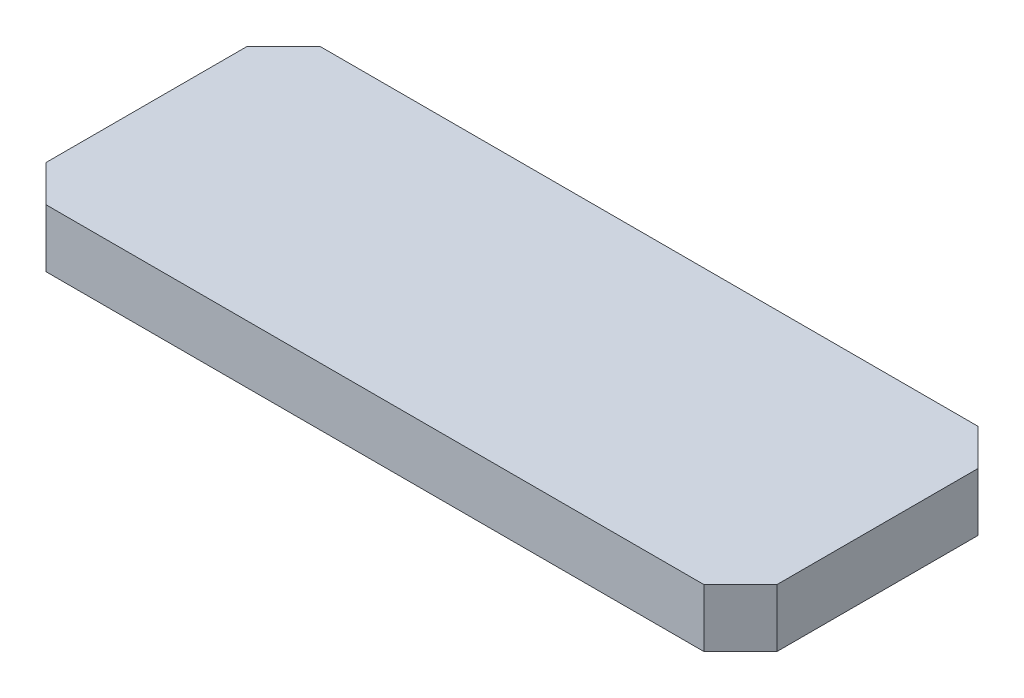
ISO-10303-21;
HEADER;
FILE_DESCRIPTION(('STEP AP214'),'2;1');
FILE_NAME('part.step','',(''),(''),'','','');
FILE_SCHEMA(('AUTOMOTIVE_DESIGN { 1 0 10303 214 1 1 1 1 }'));
ENDSEC;
DATA;
#1=APPLICATION_CONTEXT('core data for automotive mechanical design processes');
#2=APPLICATION_PROTOCOL_DEFINITION('international standard','automotive_design',2000,#1);
#3=PRODUCT_CONTEXT('',#1,'mechanical');
#4=PRODUCT('Part','Part','',(#3));
#5=PRODUCT_RELATED_PRODUCT_CATEGORY('part','',(#4));
#6=PRODUCT_DEFINITION_FORMATION('','',#4);
#7=PRODUCT_DEFINITION_CONTEXT('part definition',#1,'design');
#8=PRODUCT_DEFINITION('design','',#6,#7);
#9=PRODUCT_DEFINITION_SHAPE('','',#8);
#10=(LENGTH_UNIT() NAMED_UNIT(*) SI_UNIT(.MILLI.,.METRE.));
#11=(NAMED_UNIT(*) PLANE_ANGLE_UNIT() SI_UNIT($,.RADIAN.));
#12=(NAMED_UNIT(*) SI_UNIT($,.STERADIAN.) SOLID_ANGLE_UNIT());
#13=UNCERTAINTY_MEASURE_WITH_UNIT(LENGTH_MEASURE(1.E-05),#10,'distance_accuracy_value','');
#14=(GEOMETRIC_REPRESENTATION_CONTEXT(3) GLOBAL_UNCERTAINTY_ASSIGNED_CONTEXT((#13)) GLOBAL_UNIT_ASSIGNED_CONTEXT((#10,
#11,#12)) REPRESENTATION_CONTEXT('',''));
#15=CARTESIAN_POINT('',(0.,0.,0.));
#16=DIRECTION('',(0.,0.,1.));
#17=DIRECTION('',(1.,0.,0.));
#18=AXIS2_PLACEMENT_3D('',#15,#16,#17);
#19=CARTESIAN_POINT('',(0.,3.17500000000004,0.));
#20=DIRECTION('',(1.,0.,0.));
#21=DIRECTION('',(0.,0.,-1.));
#22=AXIS2_PLACEMENT_3D('',#19,#20,#21);
#23=PLANE('',#22);
#24=DIRECTION('',(0.,0.,1.));
#25=VECTOR('',#24,1.);
#26=CARTESIAN_POINT('',(0.,3.17500000000004,0.));
#27=LINE('',#26,#25);
#28=CARTESIAN_POINT('',(0.,3.17500000000004,-13.));
#29=VERTEX_POINT('',#28);
#30=CARTESIAN_POINT('',(0.,3.17500000000004,-2.));
#31=VERTEX_POINT('',#30);
#32=EDGE_CURVE('E119',#29,#31,#27,.T.);
#33=ORIENTED_EDGE('',*,*,#32,.F.);
#34=DIRECTION('',(0.,-1.,0.));
#35=VECTOR('',#34,1.);
#36=CARTESIAN_POINT('',(0.,3.17500000000004,-13.));
#37=LINE('',#36,#35);
#38=CARTESIAN_POINT('',(0.,0.,-13.));
#39=VERTEX_POINT('',#38);
#40=EDGE_CURVE('E104',#29,#39,#37,.T.);
#41=ORIENTED_EDGE('',*,*,#40,.T.);
#42=DIRECTION('',(0.,0.,1.));
#43=VECTOR('',#42,1.);
#44=CARTESIAN_POINT('',(0.,0.,0.));
#45=LINE('',#44,#43);
#46=CARTESIAN_POINT('',(0.,0.,-2.));
#47=VERTEX_POINT('',#46);
#48=EDGE_CURVE('E116',#39,#47,#45,.T.);
#49=ORIENTED_EDGE('',*,*,#48,.T.);
#50=DIRECTION('',(0.,1.,0.));
#51=VECTOR('',#50,1.);
#52=CARTESIAN_POINT('',(0.,3.17500000000004,-2.));
#53=LINE('',#52,#51);
#54=EDGE_CURVE('E121',#47,#31,#53,.T.);
#55=ORIENTED_EDGE('',*,*,#54,.T.);
#56=EDGE_LOOP('',(#33,#41,#49,#55));
#57=FACE_BOUND('',#56,.T.);
#58=ADVANCED_FACE('F34',(#57),#23,.F.);
#59=CARTESIAN_POINT('',(0.,3.17500000000004,0.));
#60=DIRECTION('',(0.,0.,-1.));
#61=DIRECTION('',(-1.,0.,0.));
#62=AXIS2_PLACEMENT_3D('',#59,#60,#61);
#63=PLANE('',#62);
#64=DIRECTION('',(1.,0.,0.));
#65=VECTOR('',#64,1.);
#66=CARTESIAN_POINT('',(0.,0.,0.));
#67=LINE('',#66,#65);
#68=CARTESIAN_POINT('',(2.,0.,0.));
#69=VERTEX_POINT('',#68);
#70=CARTESIAN_POINT('',(38.0000000000001,0.,0.));
#71=VERTEX_POINT('',#70);
#72=EDGE_CURVE('E125',#69,#71,#67,.T.);
#73=ORIENTED_EDGE('',*,*,#72,.T.);
#74=DIRECTION('',(0.,1.,0.));
#75=VECTOR('',#74,1.);
#76=CARTESIAN_POINT('',(38.0000000000001,3.17499999999993,0.));
#77=LINE('',#76,#75);
#78=CARTESIAN_POINT('',(38.0000000000001,3.17499999999993,0.));
#79=VERTEX_POINT('',#78);
#80=EDGE_CURVE('E11',#71,#79,#77,.T.);
#81=ORIENTED_EDGE('',*,*,#80,.T.);
#82=DIRECTION('',(1.,0.,0.));
#83=VECTOR('',#82,1.);
#84=CARTESIAN_POINT('',(0.,3.17500000000004,0.));
#85=LINE('',#84,#83);
#86=CARTESIAN_POINT('',(1.99999999999997,3.17500000000004,0.));
#87=VERTEX_POINT('',#86);
#88=EDGE_CURVE('E161',#87,#79,#85,.T.);
#89=ORIENTED_EDGE('',*,*,#88,.F.);
#90=DIRECTION('',(0.,-1.,0.));
#91=VECTOR('',#90,1.);
#92=CARTESIAN_POINT('',(1.99999999999997,3.17500000000004,0.));
#93=LINE('',#92,#91);
#94=EDGE_CURVE('E42',#87,#69,#93,.T.);
#95=ORIENTED_EDGE('',*,*,#94,.T.);
#96=EDGE_LOOP('',(#73,#81,#89,#95));
#97=FACE_BOUND('',#96,.T.);
#98=ADVANCED_FACE('F159',(#97),#63,.F.);
#99=CARTESIAN_POINT('',(40.0000000000001,3.17499999999993,0.));
#100=DIRECTION('',(-1.,0.,0.));
#101=DIRECTION('',(0.,0.,1.));
#102=AXIS2_PLACEMENT_3D('',#99,#100,#101);
#103=PLANE('',#102);
#104=DIRECTION('',(0.,0.,-1.));
#105=VECTOR('',#104,1.);
#106=CARTESIAN_POINT('',(40.0000000000001,0.,0.));
#107=LINE('',#106,#105);
#108=CARTESIAN_POINT('',(40.0000000000001,0.,-2.));
#109=VERTEX_POINT('',#108);
#110=CARTESIAN_POINT('',(40.0000000000001,0.,-13.));
#111=VERTEX_POINT('',#110);
#112=EDGE_CURVE('E128',#109,#111,#107,.T.);
#113=ORIENTED_EDGE('',*,*,#112,.T.);
#114=DIRECTION('',(0.,1.,0.));
#115=VECTOR('',#114,1.);
#116=CARTESIAN_POINT('',(40.0000000000001,3.17499999999993,-12.9999999999999));
#117=LINE('',#116,#115);
#118=CARTESIAN_POINT('',(40.0000000000001,3.17499999999993,-12.9999999999999));
#119=VERTEX_POINT('',#118);
#120=EDGE_CURVE('E49',#111,#119,#117,.T.);
#121=ORIENTED_EDGE('',*,*,#120,.T.);
#122=DIRECTION('',(0.,0.,-1.));
#123=VECTOR('',#122,1.);
#124=CARTESIAN_POINT('',(40.0000000000001,3.17499999999993,0.));
#125=LINE('',#124,#123);
#126=CARTESIAN_POINT('',(40.0000000000001,3.17500000000004,-2.));
#127=VERTEX_POINT('',#126);
#128=EDGE_CURVE('E169',#127,#119,#125,.T.);
#129=ORIENTED_EDGE('',*,*,#128,.F.);
#130=DIRECTION('',(0.,-1.,0.));
#131=VECTOR('',#130,1.);
#132=CARTESIAN_POINT('',(40.0000000000001,3.17500000000004,-2.));
#133=LINE('',#132,#131);
#134=EDGE_CURVE('E152',#127,#109,#133,.T.);
#135=ORIENTED_EDGE('',*,*,#134,.T.);
#136=EDGE_LOOP('',(#113,#121,#129,#135));
#137=FACE_BOUND('',#136,.T.);
#138=ADVANCED_FACE('F168',(#137),#103,.F.);
#139=CARTESIAN_POINT('',(0.,3.17500000000004,-15.));
#140=DIRECTION('',(0.,0.,1.));
#141=DIRECTION('',(1.,0.,0.));
#142=AXIS2_PLACEMENT_3D('',#139,#140,#141);
#143=PLANE('',#142);
#144=DIRECTION('',(-1.,0.,0.));
#145=VECTOR('',#144,1.);
#146=CARTESIAN_POINT('',(0.,0.,-15.));
#147=LINE('',#146,#145);
#148=CARTESIAN_POINT('',(38.0000000000001,0.,-15.));
#149=VERTEX_POINT('',#148);
#150=CARTESIAN_POINT('',(2.,0.,-15.));
#151=VERTEX_POINT('',#150);
#152=EDGE_CURVE('E135',#149,#151,#147,.T.);
#153=ORIENTED_EDGE('',*,*,#152,.T.);
#154=DIRECTION('',(0.,1.,0.));
#155=VECTOR('',#154,1.);
#156=CARTESIAN_POINT('',(2.,3.17500000000004,-15.));
#157=LINE('',#156,#155);
#158=CARTESIAN_POINT('',(2.,3.17500000000004,-15.));
#159=VERTEX_POINT('',#158);
#160=EDGE_CURVE('E105',#151,#159,#157,.T.);
#161=ORIENTED_EDGE('',*,*,#160,.T.);
#162=DIRECTION('',(-1.,0.,0.));
#163=VECTOR('',#162,1.);
#164=CARTESIAN_POINT('',(0.,3.17500000000004,-15.));
#165=LINE('',#164,#163);
#166=CARTESIAN_POINT('',(38.0000000000001,3.17500000000004,-15.));
#167=VERTEX_POINT('',#166);
#168=EDGE_CURVE('E131',#167,#159,#165,.T.);
#169=ORIENTED_EDGE('',*,*,#168,.F.);
#170=DIRECTION('',(0.,-1.,0.));
#171=VECTOR('',#170,1.);
#172=CARTESIAN_POINT('',(38.0000000000001,3.17500000000004,-15.));
#173=LINE('',#172,#171);
#174=EDGE_CURVE('E110',#167,#149,#173,.T.);
#175=ORIENTED_EDGE('',*,*,#174,.T.);
#176=EDGE_LOOP('',(#153,#161,#169,#175));
#177=FACE_BOUND('',#176,.T.);
#178=ADVANCED_FACE('F197',(#177),#143,.F.);
#179=CARTESIAN_POINT('',(0.,3.17500000000004,0.));
#180=DIRECTION('',(0.,-1.,0.));
#181=DIRECTION('',(0.,0.,-1.));
#182=AXIS2_PLACEMENT_3D('',#179,#180,#181);
#183=PLANE('',#182);
#184=ORIENTED_EDGE('',*,*,#168,.T.);
#185=DIRECTION('',(0.70710678118655,0.,-0.707106781186546));
#186=VECTOR('',#185,1.);
#187=CARTESIAN_POINT('',(0.,3.17500000000004,-13.));
#188=LINE('',#187,#186);
#189=EDGE_CURVE('E150',#159,#29,#188,.F.);
#190=ORIENTED_EDGE('',*,*,#189,.T.);
#191=ORIENTED_EDGE('',*,*,#32,.T.);
#192=DIRECTION('',(-0.707106781186547,0.,-0.707106781186549));
#193=VECTOR('',#192,1.);
#194=CARTESIAN_POINT('',(1.99999999999997,3.17500000000004,0.));
#195=LINE('',#194,#193);
#196=EDGE_CURVE('E145',#31,#87,#195,.F.);
#197=ORIENTED_EDGE('',*,*,#196,.T.);
#198=ORIENTED_EDGE('',*,*,#88,.T.);
#199=DIRECTION('',(-0.70710678118655,0.,0.707106781186547));
#200=VECTOR('',#199,1.);
#201=CARTESIAN_POINT('',(40.0000000000001,3.17500000000004,-2.));
#202=LINE('',#201,#200);
#203=EDGE_CURVE('E56',#79,#127,#202,.F.);
#204=ORIENTED_EDGE('',*,*,#203,.T.);
#205=ORIENTED_EDGE('',*,*,#128,.T.);
#206=DIRECTION('',(0.707106781186547,0.,0.707106781186549));
#207=VECTOR('',#206,1.);
#208=CARTESIAN_POINT('',(38.0000000000001,3.17500000000004,-15.));
#209=LINE('',#208,#207);
#210=EDGE_CURVE('E148',#119,#167,#209,.F.);
#211=ORIENTED_EDGE('',*,*,#210,.T.);
#212=EDGE_LOOP('',(#184,#190,#191,#197,#198,#204,#205,#211));
#213=FACE_BOUND('',#212,.T.);
#214=ADVANCED_FACE('F174',(#213),#183,.F.);
#215=CARTESIAN_POINT('',(0.,0.,0.));
#216=DIRECTION('',(0.,-1.,0.));
#217=DIRECTION('',(0.,0.,-1.));
#218=AXIS2_PLACEMENT_3D('',#215,#216,#217);
#219=PLANE('',#218);
#220=ORIENTED_EDGE('',*,*,#48,.F.);
#221=DIRECTION('',(-0.70710678118655,0.,0.707106781186546));
#222=VECTOR('',#221,1.);
#223=CARTESIAN_POINT('',(-6.50000000000001,1.11022302462516E-13,-6.50000000000006));
#224=LINE('',#223,#222);
#225=EDGE_CURVE('E100',#39,#151,#224,.F.);
#226=ORIENTED_EDGE('',*,*,#225,.T.);
#227=ORIENTED_EDGE('',*,*,#152,.F.);
#228=DIRECTION('',(-0.707106781186547,0.,-0.707106781186549));
#229=VECTOR('',#228,1.);
#230=CARTESIAN_POINT('',(26.5000000000002,-1.11022302462516E-13,-26.5));
#231=LINE('',#230,#229);
#232=EDGE_CURVE('E111',#149,#111,#231,.F.);
#233=ORIENTED_EDGE('',*,*,#232,.T.);
#234=ORIENTED_EDGE('',*,*,#112,.F.);
#235=DIRECTION('',(0.70710678118655,0.,-0.707106781186547));
#236=VECTOR('',#235,1.);
#237=CARTESIAN_POINT('',(18.9999999999999,0.,19.));
#238=LINE('',#237,#236);
#239=EDGE_CURVE('E139',#109,#71,#238,.F.);
#240=ORIENTED_EDGE('',*,*,#239,.T.);
#241=ORIENTED_EDGE('',*,*,#72,.F.);
#242=DIRECTION('',(0.707106781186547,0.,0.707106781186549));
#243=VECTOR('',#242,1.);
#244=CARTESIAN_POINT('',(1.,0.,-1.));
#245=LINE('',#244,#243);
#246=EDGE_CURVE('E120',#69,#47,#245,.F.);
#247=ORIENTED_EDGE('',*,*,#246,.T.);
#248=EDGE_LOOP('',(#220,#226,#227,#233,#234,#240,#241,#247));
#249=FACE_BOUND('',#248,.T.);
#250=ADVANCED_FACE('F123',(#249),#219,.T.);
#251=CARTESIAN_POINT('',(0.,3.17500000000004,-13.));
#252=DIRECTION('',(0.707106781186547,0.,0.707106781186549));
#253=DIRECTION('',(0.,-1.,0.));
#254=AXIS2_PLACEMENT_3D('',#251,#252,#253);
#255=PLANE('',#254);
#256=ORIENTED_EDGE('',*,*,#189,.F.);
#257=ORIENTED_EDGE('',*,*,#160,.F.);
#258=ORIENTED_EDGE('',*,*,#225,.F.);
#259=ORIENTED_EDGE('',*,*,#40,.F.);
#260=EDGE_LOOP('',(#256,#257,#258,#259));
#261=FACE_BOUND('',#260,.T.);
#262=ADVANCED_FACE('F103',(#261),#255,.F.);
#263=CARTESIAN_POINT('',(38.0000000000001,3.17500000000004,-15.));
#264=DIRECTION('',(-0.70710678118655,0.,0.707106781186547));
#265=DIRECTION('',(0.,-1.,0.));
#266=AXIS2_PLACEMENT_3D('',#263,#264,#265);
#267=PLANE('',#266);
#268=ORIENTED_EDGE('',*,*,#210,.F.);
#269=ORIENTED_EDGE('',*,*,#120,.F.);
#270=ORIENTED_EDGE('',*,*,#232,.F.);
#271=ORIENTED_EDGE('',*,*,#174,.F.);
#272=EDGE_LOOP('',(#268,#269,#270,#271));
#273=FACE_BOUND('',#272,.T.);
#274=ADVANCED_FACE('F179',(#273),#267,.F.);
#275=CARTESIAN_POINT('',(40.0000000000001,3.17500000000004,-2.));
#276=DIRECTION('',(-0.707106781186548,0.,-0.707106781186549));
#277=DIRECTION('',(0.,-1.,0.));
#278=AXIS2_PLACEMENT_3D('',#275,#276,#277);
#279=PLANE('',#278);
#280=ORIENTED_EDGE('',*,*,#203,.F.);
#281=ORIENTED_EDGE('',*,*,#80,.F.);
#282=ORIENTED_EDGE('',*,*,#239,.F.);
#283=ORIENTED_EDGE('',*,*,#134,.F.);
#284=EDGE_LOOP('',(#280,#281,#282,#283));
#285=FACE_BOUND('',#284,.T.);
#286=ADVANCED_FACE('F167',(#285),#279,.F.);
#287=CARTESIAN_POINT('',(1.99999999999997,3.17500000000004,0.));
#288=DIRECTION('',(0.70710678118655,0.,-0.707106781186547));
#289=DIRECTION('',(0.,-1.,0.));
#290=AXIS2_PLACEMENT_3D('',#287,#288,#289);
#291=PLANE('',#290);
#292=ORIENTED_EDGE('',*,*,#196,.F.);
#293=ORIENTED_EDGE('',*,*,#54,.F.);
#294=ORIENTED_EDGE('',*,*,#246,.F.);
#295=ORIENTED_EDGE('',*,*,#94,.F.);
#296=EDGE_LOOP('',(#292,#293,#294,#295));
#297=FACE_BOUND('',#296,.T.);
#298=ADVANCED_FACE('F36',(#297),#291,.F.);
#299=CLOSED_SHELL('',(#58,#98,#138,#178,#214,#250,#262,#274,#286,#298));
#300=MANIFOLD_SOLID_BREP('B2',#299);
#301=ADVANCED_BREP_SHAPE_REPRESENTATION('',(#18,#300),#14);
#302=SHAPE_DEFINITION_REPRESENTATION(#9,#301);
ENDSEC;
END-ISO-10303-21;
